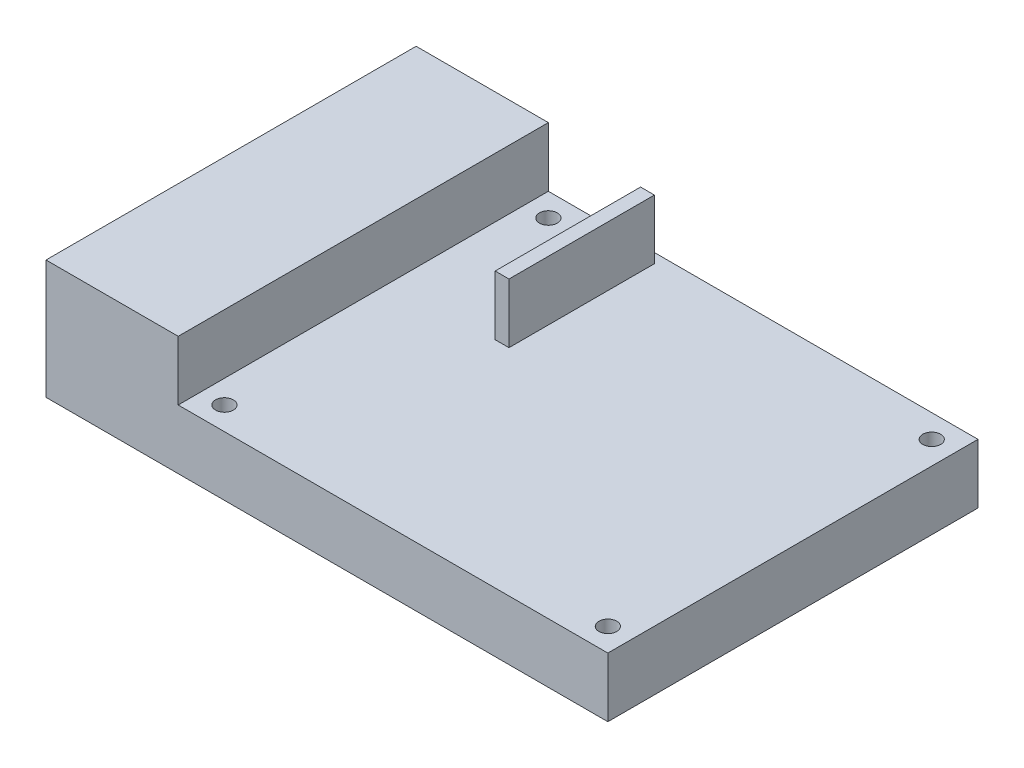
ISO-10303-21;
HEADER;
FILE_DESCRIPTION(('STEP AP214'),'2;1');
FILE_NAME('part.step','',(''),(''),'','','');
FILE_SCHEMA(('AUTOMOTIVE_DESIGN { 1 0 10303 214 1 1 1 1 }'));
ENDSEC;
DATA;
#1=APPLICATION_CONTEXT('core data for automotive mechanical design processes');
#2=APPLICATION_PROTOCOL_DEFINITION('international standard','automotive_design',2000,#1);
#3=PRODUCT_CONTEXT('',#1,'mechanical');
#4=PRODUCT('Part','Part','',(#3));
#5=PRODUCT_RELATED_PRODUCT_CATEGORY('part','',(#4));
#6=PRODUCT_DEFINITION_FORMATION('','',#4);
#7=PRODUCT_DEFINITION_CONTEXT('part definition',#1,'design');
#8=PRODUCT_DEFINITION('design','',#6,#7);
#9=PRODUCT_DEFINITION_SHAPE('','',#8);
#10=(LENGTH_UNIT() NAMED_UNIT(*) SI_UNIT(.MILLI.,.METRE.));
#11=(NAMED_UNIT(*) PLANE_ANGLE_UNIT() SI_UNIT($,.RADIAN.));
#12=(NAMED_UNIT(*) SI_UNIT($,.STERADIAN.) SOLID_ANGLE_UNIT());
#13=UNCERTAINTY_MEASURE_WITH_UNIT(LENGTH_MEASURE(1.E-05),#10,'distance_accuracy_value','');
#14=(GEOMETRIC_REPRESENTATION_CONTEXT(3) GLOBAL_UNCERTAINTY_ASSIGNED_CONTEXT((#13)) GLOBAL_UNIT_ASSIGNED_CONTEXT((#10,
#11,#12)) REPRESENTATION_CONTEXT('',''));
#15=CARTESIAN_POINT('',(0.,0.,0.));
#16=DIRECTION('',(0.,0.,1.));
#17=DIRECTION('',(1.,0.,0.));
#18=AXIS2_PLACEMENT_3D('',#15,#16,#17);
#19=CARTESIAN_POINT('',(20.,18.,0.));
#20=DIRECTION('',(1.,0.,0.));
#21=DIRECTION('',(0.,0.,-1.));
#22=AXIS2_PLACEMENT_3D('',#19,#20,#21);
#23=PLANE('',#22);
#24=DIRECTION('',(0.,0.,1.));
#25=VECTOR('',#24,1.);
#26=CARTESIAN_POINT('',(20.,9.,0.));
#27=LINE('',#26,#25);
#28=CARTESIAN_POINT('',(20.,9.,0.));
#29=VERTEX_POINT('',#28);
#30=CARTESIAN_POINT('',(20.,9.,56.));
#31=VERTEX_POINT('',#30);
#32=EDGE_CURVE('E58',#29,#31,#27,.T.);
#33=ORIENTED_EDGE('',*,*,#32,.F.);
#34=DIRECTION('',(0.,-1.,0.));
#35=VECTOR('',#34,1.);
#36=CARTESIAN_POINT('',(20.,18.,0.));
#37=LINE('',#36,#35);
#38=CARTESIAN_POINT('',(20.,18.,0.));
#39=VERTEX_POINT('',#38);
#40=EDGE_CURVE('E11',#39,#29,#37,.T.);
#41=ORIENTED_EDGE('',*,*,#40,.F.);
#42=DIRECTION('',(0.,0.,1.));
#43=VECTOR('',#42,1.);
#44=CARTESIAN_POINT('',(20.,18.,0.));
#45=LINE('',#44,#43);
#46=CARTESIAN_POINT('',(20.,18.,56.));
#47=VERTEX_POINT('',#46);
#48=EDGE_CURVE('E208',#39,#47,#45,.T.);
#49=ORIENTED_EDGE('',*,*,#48,.T.);
#50=DIRECTION('',(0.,-1.,0.));
#51=VECTOR('',#50,1.);
#52=CARTESIAN_POINT('',(20.,18.,56.));
#53=LINE('',#52,#51);
#54=EDGE_CURVE('E216',#47,#31,#53,.T.);
#55=ORIENTED_EDGE('',*,*,#54,.T.);
#56=EDGE_LOOP('',(#33,#41,#49,#55));
#57=FACE_BOUND('',#56,.T.);
#58=ADVANCED_FACE('F44',(#57),#23,.T.);
#59=CARTESIAN_POINT('',(0.,18.,0.));
#60=DIRECTION('',(0.,0.,1.));
#61=DIRECTION('',(1.,0.,0.));
#62=AXIS2_PLACEMENT_3D('',#59,#60,#61);
#63=PLANE('',#62);
#64=DIRECTION('',(-1.,0.,0.));
#65=VECTOR('',#64,1.);
#66=CARTESIAN_POINT('',(0.,0.,0.));
#67=LINE('',#66,#65);
#68=CARTESIAN_POINT('',(85.,0.,0.));
#69=VERTEX_POINT('',#68);
#70=CARTESIAN_POINT('',(0.,0.,0.));
#71=VERTEX_POINT('',#70);
#72=EDGE_CURVE('E207',#69,#71,#67,.T.);
#73=ORIENTED_EDGE('',*,*,#72,.T.);
#74=DIRECTION('',(0.,-1.,0.));
#75=VECTOR('',#74,1.);
#76=CARTESIAN_POINT('',(0.,18.,0.));
#77=LINE('',#76,#75);
#78=CARTESIAN_POINT('',(0.,18.,0.));
#79=VERTEX_POINT('',#78);
#80=EDGE_CURVE('E51',#79,#71,#77,.T.);
#81=ORIENTED_EDGE('',*,*,#80,.F.);
#82=DIRECTION('',(-1.,0.,0.));
#83=VECTOR('',#82,1.);
#84=CARTESIAN_POINT('',(0.,18.,0.));
#85=LINE('',#84,#83);
#86=EDGE_CURVE('E210',#39,#79,#85,.T.);
#87=ORIENTED_EDGE('',*,*,#86,.F.);
#88=ORIENTED_EDGE('',*,*,#40,.T.);
#89=DIRECTION('',(-1.,0.,0.));
#90=VECTOR('',#89,1.);
#91=CARTESIAN_POINT('',(0.,9.,0.));
#92=LINE('',#91,#90);
#93=CARTESIAN_POINT('',(85.,9.,0.));
#94=VERTEX_POINT('',#93);
#95=EDGE_CURVE('E183',#94,#29,#92,.T.);
#96=ORIENTED_EDGE('',*,*,#95,.F.);
#97=DIRECTION('',(0.,-1.,0.));
#98=VECTOR('',#97,1.);
#99=CARTESIAN_POINT('',(85.,9.,0.));
#100=LINE('',#99,#98);
#101=EDGE_CURVE('E190',#94,#69,#100,.T.);
#102=ORIENTED_EDGE('',*,*,#101,.T.);
#103=EDGE_LOOP('',(#73,#81,#87,#88,#96,#102));
#104=FACE_BOUND('',#103,.T.);
#105=ADVANCED_FACE('F243',(#104),#63,.F.);
#106=CARTESIAN_POINT('',(0.,18.,0.));
#107=DIRECTION('',(1.,0.,0.));
#108=DIRECTION('',(0.,0.,-1.));
#109=AXIS2_PLACEMENT_3D('',#106,#107,#108);
#110=PLANE('',#109);
#111=DIRECTION('',(0.,0.,1.));
#112=VECTOR('',#111,1.);
#113=CARTESIAN_POINT('',(0.,0.,0.));
#114=LINE('',#113,#112);
#115=CARTESIAN_POINT('',(0.,0.,56.));
#116=VERTEX_POINT('',#115);
#117=EDGE_CURVE('E82',#71,#116,#114,.T.);
#118=ORIENTED_EDGE('',*,*,#117,.T.);
#119=DIRECTION('',(0.,-1.,0.));
#120=VECTOR('',#119,1.);
#121=CARTESIAN_POINT('',(0.,18.,56.));
#122=LINE('',#121,#120);
#123=CARTESIAN_POINT('',(0.,18.,56.));
#124=VERTEX_POINT('',#123);
#125=EDGE_CURVE('E221',#124,#116,#122,.T.);
#126=ORIENTED_EDGE('',*,*,#125,.F.);
#127=DIRECTION('',(0.,0.,1.));
#128=VECTOR('',#127,1.);
#129=CARTESIAN_POINT('',(0.,18.,0.));
#130=LINE('',#129,#128);
#131=EDGE_CURVE('E213',#79,#124,#130,.T.);
#132=ORIENTED_EDGE('',*,*,#131,.F.);
#133=ORIENTED_EDGE('',*,*,#80,.T.);
#134=EDGE_LOOP('',(#118,#126,#132,#133));
#135=FACE_BOUND('',#134,.T.);
#136=ADVANCED_FACE('F224',(#135),#110,.F.);
#137=CARTESIAN_POINT('',(0.,18.,56.));
#138=DIRECTION('',(0.,0.,-1.));
#139=DIRECTION('',(-1.,0.,0.));
#140=AXIS2_PLACEMENT_3D('',#137,#138,#139);
#141=PLANE('',#140);
#142=DIRECTION('',(1.,0.,0.));
#143=VECTOR('',#142,1.);
#144=CARTESIAN_POINT('',(0.,0.,56.));
#145=LINE('',#144,#143);
#146=CARTESIAN_POINT('',(85.,0.,56.));
#147=VERTEX_POINT('',#146);
#148=EDGE_CURVE('E211',#116,#147,#145,.T.);
#149=ORIENTED_EDGE('',*,*,#148,.T.);
#150=DIRECTION('',(0.,-1.,0.));
#151=VECTOR('',#150,1.);
#152=CARTESIAN_POINT('',(85.,9.,56.));
#153=LINE('',#152,#151);
#154=CARTESIAN_POINT('',(85.,9.,56.));
#155=VERTEX_POINT('',#154);
#156=EDGE_CURVE('E204',#155,#147,#153,.T.);
#157=ORIENTED_EDGE('',*,*,#156,.F.);
#158=DIRECTION('',(1.,0.,0.));
#159=VECTOR('',#158,1.);
#160=CARTESIAN_POINT('',(0.,9.,56.));
#161=LINE('',#160,#159);
#162=EDGE_CURVE('E187',#31,#155,#161,.T.);
#163=ORIENTED_EDGE('',*,*,#162,.F.);
#164=ORIENTED_EDGE('',*,*,#54,.F.);
#165=DIRECTION('',(1.,0.,0.));
#166=VECTOR('',#165,1.);
#167=CARTESIAN_POINT('',(0.,18.,56.));
#168=LINE('',#167,#166);
#169=EDGE_CURVE('E66',#124,#47,#168,.T.);
#170=ORIENTED_EDGE('',*,*,#169,.F.);
#171=ORIENTED_EDGE('',*,*,#125,.T.);
#172=EDGE_LOOP('',(#149,#157,#163,#164,#170,#171));
#173=FACE_BOUND('',#172,.T.);
#174=ADVANCED_FACE('F233',(#173),#141,.F.);
#175=CARTESIAN_POINT('',(0.,18.,0.));
#176=DIRECTION('',(0.,1.,0.));
#177=DIRECTION('',(0.,0.,1.));
#178=AXIS2_PLACEMENT_3D('',#175,#176,#177);
#179=PLANE('',#178);
#180=ORIENTED_EDGE('',*,*,#48,.F.);
#181=ORIENTED_EDGE('',*,*,#86,.T.);
#182=ORIENTED_EDGE('',*,*,#131,.T.);
#183=ORIENTED_EDGE('',*,*,#169,.T.);
#184=EDGE_LOOP('',(#180,#181,#182,#183));
#185=FACE_BOUND('',#184,.T.);
#186=ADVANCED_FACE('F242',(#185),#179,.T.);
#187=CARTESIAN_POINT('',(0.,0.,0.));
#188=DIRECTION('',(0.,1.,0.));
#189=DIRECTION('',(0.,0.,1.));
#190=AXIS2_PLACEMENT_3D('',#187,#188,#189);
#191=PLANE('',#190);
#192=ORIENTED_EDGE('',*,*,#72,.F.);
#193=DIRECTION('',(0.,0.,-1.));
#194=VECTOR('',#193,1.);
#195=CARTESIAN_POINT('',(85.,0.,0.));
#196=LINE('',#195,#194);
#197=EDGE_CURVE('E165',#147,#69,#196,.T.);
#198=ORIENTED_EDGE('',*,*,#197,.F.);
#199=ORIENTED_EDGE('',*,*,#148,.F.);
#200=ORIENTED_EDGE('',*,*,#117,.F.);
#201=EDGE_LOOP('',(#192,#198,#199,#200));
#202=FACE_BOUND('',#201,.T.);
#203=CARTESIAN_POINT('',(81.5,0.,3.5));
#204=DIRECTION('',(0.,1.,0.));
#205=DIRECTION('',(0.,0.,1.));
#206=AXIS2_PLACEMENT_3D('',#203,#204,#205);
#207=CIRCLE('',#206,1.35000000000001);
#208=CARTESIAN_POINT('',(81.5,0.,4.85));
#209=VERTEX_POINT('',#208);
#210=EDGE_CURVE('E152',#209,#209,#207,.T.);
#211=ORIENTED_EDGE('',*,*,#210,.T.);
#212=EDGE_LOOP('',(#211));
#213=FACE_BOUND('',#212,.T.);
#214=CARTESIAN_POINT('',(81.5,0.,52.5));
#215=DIRECTION('',(0.,1.,0.));
#216=DIRECTION('',(0.,0.,1.));
#217=AXIS2_PLACEMENT_3D('',#214,#215,#216);
#218=CIRCLE('',#217,1.35000000000001);
#219=CARTESIAN_POINT('',(81.5,0.,53.85));
#220=VERTEX_POINT('',#219);
#221=EDGE_CURVE('E156',#220,#220,#218,.T.);
#222=ORIENTED_EDGE('',*,*,#221,.T.);
#223=EDGE_LOOP('',(#222));
#224=FACE_BOUND('',#223,.T.);
#225=CARTESIAN_POINT('',(23.5,0.,52.5));
#226=DIRECTION('',(0.,1.,0.));
#227=DIRECTION('',(0.,0.,1.));
#228=AXIS2_PLACEMENT_3D('',#225,#226,#227);
#229=CIRCLE('',#228,1.35);
#230=CARTESIAN_POINT('',(23.5,0.,53.85));
#231=VERTEX_POINT('',#230);
#232=EDGE_CURVE('E194',#231,#231,#229,.T.);
#233=ORIENTED_EDGE('',*,*,#232,.T.);
#234=EDGE_LOOP('',(#233));
#235=FACE_BOUND('',#234,.T.);
#236=CARTESIAN_POINT('',(23.5,0.,3.5));
#237=DIRECTION('',(0.,1.,0.));
#238=DIRECTION('',(0.,0.,1.));
#239=AXIS2_PLACEMENT_3D('',#236,#237,#238);
#240=CIRCLE('',#239,1.35);
#241=CARTESIAN_POINT('',(23.5,0.,4.85));
#242=VERTEX_POINT('',#241);
#243=EDGE_CURVE('E197',#242,#242,#240,.T.);
#244=ORIENTED_EDGE('',*,*,#243,.T.);
#245=EDGE_LOOP('',(#244));
#246=FACE_BOUND('',#245,.T.);
#247=ADVANCED_FACE('F228',(#202,#213,#224,#235,#246),#191,.F.);
#248=CARTESIAN_POINT('',(23.5,9.,3.5));
#249=DIRECTION('',(0.,-1.,0.));
#250=DIRECTION('',(0.,0.,-1.));
#251=AXIS2_PLACEMENT_3D('',#248,#249,#250);
#252=CYLINDRICAL_SURFACE('',#251,1.35);
#253=CARTESIAN_POINT('',(23.5,9.,3.5));
#254=DIRECTION('',(0.,1.,0.));
#255=DIRECTION('',(0.,0.,1.));
#256=AXIS2_PLACEMENT_3D('',#253,#254,#255);
#257=CIRCLE('',#256,1.35);
#258=CARTESIAN_POINT('',(23.5,9.,4.85));
#259=VERTEX_POINT('',#258);
#260=EDGE_CURVE('E171',#259,#259,#257,.T.);
#261=ORIENTED_EDGE('',*,*,#260,.T.);
#262=EDGE_LOOP('',(#261));
#263=FACE_BOUND('',#262,.T.);
#264=ORIENTED_EDGE('',*,*,#243,.F.);
#265=EDGE_LOOP('',(#264));
#266=FACE_BOUND('',#265,.T.);
#267=ADVANCED_FACE('F255',(#263,#266),#252,.F.);
#268=CARTESIAN_POINT('',(23.5,9.,52.5));
#269=DIRECTION('',(0.,-1.,0.));
#270=DIRECTION('',(0.,0.,-1.));
#271=AXIS2_PLACEMENT_3D('',#268,#269,#270);
#272=CYLINDRICAL_SURFACE('',#271,1.35);
#273=CARTESIAN_POINT('',(23.5,9.,52.5));
#274=DIRECTION('',(0.,1.,0.));
#275=DIRECTION('',(0.,0.,1.));
#276=AXIS2_PLACEMENT_3D('',#273,#274,#275);
#277=CIRCLE('',#276,1.35);
#278=CARTESIAN_POINT('',(23.5,9.,53.85));
#279=VERTEX_POINT('',#278);
#280=EDGE_CURVE('E168',#279,#279,#277,.T.);
#281=ORIENTED_EDGE('',*,*,#280,.T.);
#282=EDGE_LOOP('',(#281));
#283=FACE_BOUND('',#282,.T.);
#284=ORIENTED_EDGE('',*,*,#232,.F.);
#285=EDGE_LOOP('',(#284));
#286=FACE_BOUND('',#285,.T.);
#287=ADVANCED_FACE('F265',(#283,#286),#272,.F.);
#288=CARTESIAN_POINT('',(81.5,9.,52.5));
#289=DIRECTION('',(0.,-1.,0.));
#290=DIRECTION('',(0.,0.,-1.));
#291=AXIS2_PLACEMENT_3D('',#288,#289,#290);
#292=CYLINDRICAL_SURFACE('',#291,1.35000000000001);
#293=CARTESIAN_POINT('',(81.5,9.,52.5));
#294=DIRECTION('',(0.,1.,0.));
#295=DIRECTION('',(0.,0.,1.));
#296=AXIS2_PLACEMENT_3D('',#293,#294,#295);
#297=CIRCLE('',#296,1.35000000000001);
#298=CARTESIAN_POINT('',(81.5,9.,53.85));
#299=VERTEX_POINT('',#298);
#300=EDGE_CURVE('E164',#299,#299,#297,.T.);
#301=ORIENTED_EDGE('',*,*,#300,.T.);
#302=EDGE_LOOP('',(#301));
#303=FACE_BOUND('',#302,.T.);
#304=ORIENTED_EDGE('',*,*,#221,.F.);
#305=EDGE_LOOP('',(#304));
#306=FACE_BOUND('',#305,.T.);
#307=ADVANCED_FACE('F261',(#303,#306),#292,.F.);
#308=CARTESIAN_POINT('',(81.5,9.,3.5));
#309=DIRECTION('',(0.,-1.,0.));
#310=DIRECTION('',(0.,0.,-1.));
#311=AXIS2_PLACEMENT_3D('',#308,#309,#310);
#312=CYLINDRICAL_SURFACE('',#311,1.35000000000001);
#313=CARTESIAN_POINT('',(81.5,9.,3.5));
#314=DIRECTION('',(0.,1.,0.));
#315=DIRECTION('',(0.,0.,1.));
#316=AXIS2_PLACEMENT_3D('',#313,#314,#315);
#317=CIRCLE('',#316,1.35000000000001);
#318=CARTESIAN_POINT('',(81.5,9.,4.85));
#319=VERTEX_POINT('',#318);
#320=EDGE_CURVE('E161',#319,#319,#317,.T.);
#321=ORIENTED_EDGE('',*,*,#320,.T.);
#322=EDGE_LOOP('',(#321));
#323=FACE_BOUND('',#322,.T.);
#324=ORIENTED_EDGE('',*,*,#210,.F.);
#325=EDGE_LOOP('',(#324));
#326=FACE_BOUND('',#325,.T.);
#327=ADVANCED_FACE('F258',(#323,#326),#312,.F.);
#328=CARTESIAN_POINT('',(85.,9.,0.));
#329=DIRECTION('',(-1.,0.,0.));
#330=DIRECTION('',(0.,0.,1.));
#331=AXIS2_PLACEMENT_3D('',#328,#329,#330);
#332=PLANE('',#331);
#333=ORIENTED_EDGE('',*,*,#197,.T.);
#334=ORIENTED_EDGE('',*,*,#101,.F.);
#335=DIRECTION('',(0.,0.,-1.));
#336=VECTOR('',#335,1.);
#337=CARTESIAN_POINT('',(85.,9.,0.));
#338=LINE('',#337,#336);
#339=EDGE_CURVE('E189',#155,#94,#338,.T.);
#340=ORIENTED_EDGE('',*,*,#339,.F.);
#341=ORIENTED_EDGE('',*,*,#156,.T.);
#342=EDGE_LOOP('',(#333,#334,#340,#341));
#343=FACE_BOUND('',#342,.T.);
#344=ADVANCED_FACE('F237',(#343),#332,.F.);
#345=CARTESIAN_POINT('',(0.,9.,0.));
#346=DIRECTION('',(0.,1.,0.));
#347=DIRECTION('',(0.,0.,1.));
#348=AXIS2_PLACEMENT_3D('',#345,#346,#347);
#349=PLANE('',#348);
#350=ORIENTED_EDGE('',*,*,#320,.F.);
#351=EDGE_LOOP('',(#350));
#352=FACE_BOUND('',#351,.T.);
#353=ORIENTED_EDGE('',*,*,#300,.F.);
#354=EDGE_LOOP('',(#353));
#355=FACE_BOUND('',#354,.T.);
#356=ORIENTED_EDGE('',*,*,#280,.F.);
#357=EDGE_LOOP('',(#356));
#358=FACE_BOUND('',#357,.T.);
#359=ORIENTED_EDGE('',*,*,#260,.F.);
#360=EDGE_LOOP('',(#359));
#361=FACE_BOUND('',#360,.T.);
#362=DIRECTION('',(-1.,0.,0.));
#363=VECTOR('',#362,1.);
#364=CARTESIAN_POINT('',(0.,9.,1.46948846535639));
#365=LINE('',#364,#363);
#366=CARTESIAN_POINT('',(37.513362080482,9.,1.46948846535639));
#367=VERTEX_POINT('',#366);
#368=CARTESIAN_POINT('',(35.42,9.,1.46948846535639));
#369=VERTEX_POINT('',#368);
#370=EDGE_CURVE('E174',#367,#369,#365,.T.);
#371=ORIENTED_EDGE('',*,*,#370,.F.);
#372=DIRECTION('',(0.,0.,-1.));
#373=VECTOR('',#372,1.);
#374=CARTESIAN_POINT('',(37.513362080482,9.,0.));
#375=LINE('',#374,#373);
#376=CARTESIAN_POINT('',(37.513362080482,9.,23.4694884653564));
#377=VERTEX_POINT('',#376);
#378=EDGE_CURVE('E177',#377,#367,#375,.T.);
#379=ORIENTED_EDGE('',*,*,#378,.F.);
#380=DIRECTION('',(1.,0.,0.));
#381=VECTOR('',#380,1.);
#382=CARTESIAN_POINT('',(0.,9.,23.4694884653564));
#383=LINE('',#382,#381);
#384=CARTESIAN_POINT('',(35.42,9.,23.4694884653564));
#385=VERTEX_POINT('',#384);
#386=EDGE_CURVE('E144',#385,#377,#383,.T.);
#387=ORIENTED_EDGE('',*,*,#386,.F.);
#388=DIRECTION('',(0.,0.,1.));
#389=VECTOR('',#388,1.);
#390=CARTESIAN_POINT('',(35.42,9.,0.));
#391=LINE('',#390,#389);
#392=EDGE_CURVE('E180',#369,#385,#391,.T.);
#393=ORIENTED_EDGE('',*,*,#392,.F.);
#394=EDGE_LOOP('',(#371,#379,#387,#393));
#395=FACE_BOUND('',#394,.T.);
#396=ORIENTED_EDGE('',*,*,#95,.T.);
#397=ORIENTED_EDGE('',*,*,#32,.T.);
#398=ORIENTED_EDGE('',*,*,#162,.T.);
#399=ORIENTED_EDGE('',*,*,#339,.T.);
#400=EDGE_LOOP('',(#396,#397,#398,#399));
#401=FACE_BOUND('',#400,.T.);
#402=ADVANCED_FACE('F241',(#352,#355,#358,#361,#395,#401),#349,.T.);
#403=CARTESIAN_POINT('',(0.,18.,0.));
#404=DIRECTION('',(0.,1.,0.));
#405=DIRECTION('',(0.,0.,1.));
#406=AXIS2_PLACEMENT_3D('',#403,#404,#405);
#407=PLANE('',#406);
#408=DIRECTION('',(0.,0.,-1.));
#409=VECTOR('',#408,1.);
#410=CARTESIAN_POINT('',(37.513362080482,18.,23.4694884653564));
#411=LINE('',#410,#409);
#412=CARTESIAN_POINT('',(37.513362080482,18.,23.4694884653564));
#413=VERTEX_POINT('',#412);
#414=CARTESIAN_POINT('',(37.513362080482,18.,1.46948846535639));
#415=VERTEX_POINT('',#414);
#416=EDGE_CURVE('E132',#413,#415,#411,.T.);
#417=ORIENTED_EDGE('',*,*,#416,.T.);
#418=DIRECTION('',(-1.,0.,0.));
#419=VECTOR('',#418,1.);
#420=CARTESIAN_POINT('',(37.513362080482,18.,1.46948846535639));
#421=LINE('',#420,#419);
#422=CARTESIAN_POINT('',(35.42,18.,1.46948846535639));
#423=VERTEX_POINT('',#422);
#424=EDGE_CURVE('E153',#415,#423,#421,.T.);
#425=ORIENTED_EDGE('',*,*,#424,.T.);
#426=DIRECTION('',(0.,0.,1.));
#427=VECTOR('',#426,1.);
#428=CARTESIAN_POINT('',(35.42,18.,1.46948846535639));
#429=LINE('',#428,#427);
#430=CARTESIAN_POINT('',(35.42,18.,23.4694884653564));
#431=VERTEX_POINT('',#430);
#432=EDGE_CURVE('E135',#423,#431,#429,.T.);
#433=ORIENTED_EDGE('',*,*,#432,.T.);
#434=DIRECTION('',(1.,0.,0.));
#435=VECTOR('',#434,1.);
#436=CARTESIAN_POINT('',(35.42,18.,23.4694884653564));
#437=LINE('',#436,#435);
#438=EDGE_CURVE('E128',#431,#413,#437,.T.);
#439=ORIENTED_EDGE('',*,*,#438,.T.);
#440=EDGE_LOOP('',(#417,#425,#433,#439));
#441=FACE_BOUND('',#440,.T.);
#442=ADVANCED_FACE('F130',(#441),#407,.T.);
#443=CARTESIAN_POINT('',(35.42,18.,23.4694884653564));
#444=DIRECTION('',(0.,0.,-1.));
#445=DIRECTION('',(-1.,0.,0.));
#446=AXIS2_PLACEMENT_3D('',#443,#444,#445);
#447=PLANE('',#446);
#448=ORIENTED_EDGE('',*,*,#386,.T.);
#449=DIRECTION('',(0.,-1.,0.));
#450=VECTOR('',#449,1.);
#451=CARTESIAN_POINT('',(37.513362080482,18.,23.4694884653564));
#452=LINE('',#451,#450);
#453=EDGE_CURVE('E139',#413,#377,#452,.T.);
#454=ORIENTED_EDGE('',*,*,#453,.F.);
#455=ORIENTED_EDGE('',*,*,#438,.F.);
#456=DIRECTION('',(0.,-1.,0.));
#457=VECTOR('',#456,1.);
#458=CARTESIAN_POINT('',(35.42,18.,23.4694884653564));
#459=LINE('',#458,#457);
#460=EDGE_CURVE('E147',#431,#385,#459,.T.);
#461=ORIENTED_EDGE('',*,*,#460,.T.);
#462=EDGE_LOOP('',(#448,#454,#455,#461));
#463=FACE_BOUND('',#462,.T.);
#464=ADVANCED_FACE('F143',(#463),#447,.F.);
#465=CARTESIAN_POINT('',(35.42,18.,1.46948846535639));
#466=DIRECTION('',(1.,0.,0.));
#467=DIRECTION('',(0.,0.,-1.));
#468=AXIS2_PLACEMENT_3D('',#465,#466,#467);
#469=PLANE('',#468);
#470=ORIENTED_EDGE('',*,*,#392,.T.);
#471=ORIENTED_EDGE('',*,*,#460,.F.);
#472=ORIENTED_EDGE('',*,*,#432,.F.);
#473=DIRECTION('',(0.,-1.,0.));
#474=VECTOR('',#473,1.);
#475=CARTESIAN_POINT('',(35.42,18.,1.46948846535639));
#476=LINE('',#475,#474);
#477=EDGE_CURVE('E405',#423,#369,#476,.T.);
#478=ORIENTED_EDGE('',*,*,#477,.T.);
#479=EDGE_LOOP('',(#470,#471,#472,#478));
#480=FACE_BOUND('',#479,.T.);
#481=ADVANCED_FACE('F282',(#480),#469,.F.);
#482=CARTESIAN_POINT('',(37.513362080482,18.,1.46948846535639));
#483=DIRECTION('',(0.,0.,1.));
#484=DIRECTION('',(1.,0.,0.));
#485=AXIS2_PLACEMENT_3D('',#482,#483,#484);
#486=PLANE('',#485);
#487=ORIENTED_EDGE('',*,*,#370,.T.);
#488=ORIENTED_EDGE('',*,*,#477,.F.);
#489=ORIENTED_EDGE('',*,*,#424,.F.);
#490=DIRECTION('',(0.,-1.,0.));
#491=VECTOR('',#490,1.);
#492=CARTESIAN_POINT('',(37.513362080482,18.,1.46948846535639));
#493=LINE('',#492,#491);
#494=EDGE_CURVE('E151',#415,#367,#493,.T.);
#495=ORIENTED_EDGE('',*,*,#494,.T.);
#496=EDGE_LOOP('',(#487,#488,#489,#495));
#497=FACE_BOUND('',#496,.T.);
#498=ADVANCED_FACE('F285',(#497),#486,.F.);
#499=CARTESIAN_POINT('',(37.513362080482,18.,23.4694884653564));
#500=DIRECTION('',(-1.,0.,0.));
#501=DIRECTION('',(0.,0.,1.));
#502=AXIS2_PLACEMENT_3D('',#499,#500,#501);
#503=PLANE('',#502);
#504=ORIENTED_EDGE('',*,*,#378,.T.);
#505=ORIENTED_EDGE('',*,*,#494,.F.);
#506=ORIENTED_EDGE('',*,*,#416,.F.);
#507=ORIENTED_EDGE('',*,*,#453,.T.);
#508=EDGE_LOOP('',(#504,#505,#506,#507));
#509=FACE_BOUND('',#508,.T.);
#510=ADVANCED_FACE('F149',(#509),#503,.F.);
#511=CLOSED_SHELL('',(#58,#105,#136,#174,#186,#247,#267,#287,#307,#327,#344,#402,#442,#464,#481,
#498,#510));
#512=MANIFOLD_SOLID_BREP('B2',#511);
#513=ADVANCED_BREP_SHAPE_REPRESENTATION('',(#18,#512),#14);
#514=SHAPE_DEFINITION_REPRESENTATION(#9,#513);
ENDSEC;
END-ISO-10303-21;
